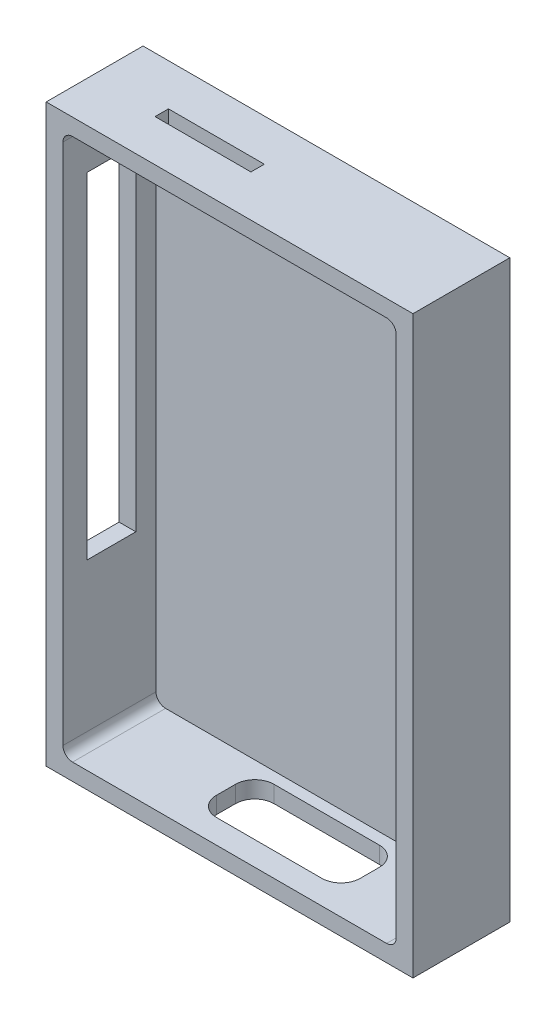
ISO-10303-21;
HEADER;
FILE_DESCRIPTION(('STEP AP214'),'2;1');
FILE_NAME('part.step','',(''),(''),'','','');
FILE_SCHEMA(('AUTOMOTIVE_DESIGN { 1 0 10303 214 1 1 1 1 }'));
ENDSEC;
DATA;
#1=APPLICATION_CONTEXT('core data for automotive mechanical design processes');
#2=APPLICATION_PROTOCOL_DEFINITION('international standard','automotive_design',2000,#1);
#3=PRODUCT_CONTEXT('',#1,'mechanical');
#4=PRODUCT('Part','Part','',(#3));
#5=PRODUCT_RELATED_PRODUCT_CATEGORY('part','',(#4));
#6=PRODUCT_DEFINITION_FORMATION('','',#4);
#7=PRODUCT_DEFINITION_CONTEXT('part definition',#1,'design');
#8=PRODUCT_DEFINITION('design','',#6,#7);
#9=PRODUCT_DEFINITION_SHAPE('','',#8);
#10=(LENGTH_UNIT() NAMED_UNIT(*) SI_UNIT(.MILLI.,.METRE.));
#11=(NAMED_UNIT(*) PLANE_ANGLE_UNIT() SI_UNIT($,.RADIAN.));
#12=(NAMED_UNIT(*) SI_UNIT($,.STERADIAN.) SOLID_ANGLE_UNIT());
#13=UNCERTAINTY_MEASURE_WITH_UNIT(LENGTH_MEASURE(1.E-05),#10,'distance_accuracy_value','');
#14=(GEOMETRIC_REPRESENTATION_CONTEXT(3) GLOBAL_UNCERTAINTY_ASSIGNED_CONTEXT((#13)) GLOBAL_UNIT_ASSIGNED_CONTEXT((#10,
#11,#12)) REPRESENTATION_CONTEXT('',''));
#15=CARTESIAN_POINT('',(0.,0.,0.));
#16=DIRECTION('',(0.,0.,1.));
#17=DIRECTION('',(1.,0.,0.));
#18=AXIS2_PLACEMENT_3D('',#15,#16,#17);
#19=CARTESIAN_POINT('',(0.,0.,0.8));
#20=DIRECTION('',(1.,0.,0.));
#21=DIRECTION('',(0.,0.,-1.));
#22=AXIS2_PLACEMENT_3D('',#19,#20,#21);
#23=PLANE('',#22);
#24=DIRECTION('',(0.,1.,0.));
#25=VECTOR('',#24,1.);
#26=CARTESIAN_POINT('',(0.,106.5,15.2));
#27=LINE('',#26,#25);
#28=CARTESIAN_POINT('',(0.,36.5,15.2));
#29=VERTEX_POINT('',#28);
#30=CARTESIAN_POINT('',(0.,106.5,15.2));
#31=VERTEX_POINT('',#30);
#32=EDGE_CURVE('E267',#29,#31,#27,.T.);
#33=ORIENTED_EDGE('',*,*,#32,.F.);
#34=DIRECTION('',(0.,0.,1.));
#35=VECTOR('',#34,1.);
#36=CARTESIAN_POINT('',(0.,36.5,5.00000000000001));
#37=LINE('',#36,#35);
#38=CARTESIAN_POINT('',(0.,36.5,5.00000000000001));
#39=VERTEX_POINT('',#38);
#40=EDGE_CURVE('E270',#39,#29,#37,.T.);
#41=ORIENTED_EDGE('',*,*,#40,.F.);
#42=DIRECTION('',(0.,-1.,0.));
#43=VECTOR('',#42,1.);
#44=CARTESIAN_POINT('',(0.,106.5,5.));
#45=LINE('',#44,#43);
#46=CARTESIAN_POINT('',(0.,106.5,5.));
#47=VERTEX_POINT('',#46);
#48=EDGE_CURVE('E263',#47,#39,#45,.T.);
#49=ORIENTED_EDGE('',*,*,#48,.F.);
#50=DIRECTION('',(0.,0.,-1.));
#51=VECTOR('',#50,1.);
#52=CARTESIAN_POINT('',(0.,106.5,5.));
#53=LINE('',#52,#51);
#54=EDGE_CURVE('E264',#31,#47,#53,.T.);
#55=ORIENTED_EDGE('',*,*,#54,.F.);
#56=EDGE_LOOP('',(#33,#41,#49,#55));
#57=FACE_BOUND('',#56,.T.);
#58=DIRECTION('',(0.,-1.,0.));
#59=VECTOR('',#58,1.);
#60=CARTESIAN_POINT('',(0.,0.,0.));
#61=LINE('',#60,#59);
#62=CARTESIAN_POINT('',(0.,120.,0.));
#63=VERTEX_POINT('',#62);
#64=CARTESIAN_POINT('',(0.,0.,0.));
#65=VERTEX_POINT('',#64);
#66=EDGE_CURVE('E331',#63,#65,#61,.T.);
#67=ORIENTED_EDGE('',*,*,#66,.T.);
#68=DIRECTION('',(0.,0.,-1.));
#69=VECTOR('',#68,1.);
#70=CARTESIAN_POINT('',(0.,0.,0.8));
#71=LINE('',#70,#69);
#72=CARTESIAN_POINT('',(0.,0.,20.2));
#73=VERTEX_POINT('',#72);
#74=EDGE_CURVE('E349',#73,#65,#71,.T.);
#75=ORIENTED_EDGE('',*,*,#74,.F.);
#76=DIRECTION('',(0.,-1.,0.));
#77=VECTOR('',#76,1.);
#78=CARTESIAN_POINT('',(0.,120.,20.2));
#79=LINE('',#78,#77);
#80=CARTESIAN_POINT('',(0.,120.,20.2));
#81=VERTEX_POINT('',#80);
#82=EDGE_CURVE('E309',#81,#73,#79,.T.);
#83=ORIENTED_EDGE('',*,*,#82,.F.);
#84=DIRECTION('',(0.,0.,-1.));
#85=VECTOR('',#84,1.);
#86=CARTESIAN_POINT('',(0.,120.,0.8));
#87=LINE('',#86,#85);
#88=EDGE_CURVE('E340',#81,#63,#87,.T.);
#89=ORIENTED_EDGE('',*,*,#88,.T.);
#90=EDGE_LOOP('',(#67,#75,#83,#89));
#91=FACE_BOUND('',#90,.T.);
#92=ADVANCED_FACE('F32',(#57,#91),#23,.F.);
#93=CARTESIAN_POINT('',(0.,0.,0.8));
#94=DIRECTION('',(0.,1.,0.));
#95=DIRECTION('',(0.,0.,1.));
#96=AXIS2_PLACEMENT_3D('',#93,#94,#95);
#97=PLANE('',#96);
#98=DIRECTION('',(-1.,0.,0.));
#99=VECTOR('',#98,1.);
#100=CARTESIAN_POINT('',(56.5,0.,15.2));
#101=LINE('',#100,#99);
#102=CARTESIAN_POINT('',(52.5,0.,15.2));
#103=VERTEX_POINT('',#102);
#104=CARTESIAN_POINT('',(30.5,0.,15.2));
#105=VERTEX_POINT('',#104);
#106=EDGE_CURVE('E254',#103,#105,#101,.T.);
#107=ORIENTED_EDGE('',*,*,#106,.F.);
#108=CARTESIAN_POINT('',(52.5,0.,11.2));
#109=DIRECTION('',(0.,1.,0.));
#110=DIRECTION('',(0.,0.,1.));
#111=AXIS2_PLACEMENT_3D('',#108,#109,#110);
#112=CIRCLE('',#111,4.);
#113=CARTESIAN_POINT('',(56.5,0.,11.2));
#114=VERTEX_POINT('',#113);
#115=EDGE_CURVE('E428',#103,#114,#112,.T.);
#116=ORIENTED_EDGE('',*,*,#115,.T.);
#117=DIRECTION('',(0.,0.,1.));
#118=VECTOR('',#117,1.);
#119=CARTESIAN_POINT('',(56.5,0.,15.2));
#120=LINE('',#119,#118);
#121=CARTESIAN_POINT('',(56.5,0.,7.19999999999999));
#122=VERTEX_POINT('',#121);
#123=EDGE_CURVE('E233',#122,#114,#120,.T.);
#124=ORIENTED_EDGE('',*,*,#123,.F.);
#125=CARTESIAN_POINT('',(52.5,0.,7.19999999999999));
#126=DIRECTION('',(0.,1.,0.));
#127=DIRECTION('',(0.,0.,1.));
#128=AXIS2_PLACEMENT_3D('',#125,#126,#127);
#129=CIRCLE('',#128,4.);
#130=CARTESIAN_POINT('',(52.5,0.,3.19999999999999));
#131=VERTEX_POINT('',#130);
#132=EDGE_CURVE('E40',#122,#131,#129,.T.);
#133=ORIENTED_EDGE('',*,*,#132,.T.);
#134=DIRECTION('',(1.,0.,0.));
#135=VECTOR('',#134,1.);
#136=CARTESIAN_POINT('',(56.5,0.,3.19999999999999));
#137=LINE('',#136,#135);
#138=CARTESIAN_POINT('',(30.5,0.,3.19999999999999));
#139=VERTEX_POINT('',#138);
#140=EDGE_CURVE('E260',#139,#131,#137,.T.);
#141=ORIENTED_EDGE('',*,*,#140,.F.);
#142=CARTESIAN_POINT('',(30.5,0.,7.19999999999999));
#143=DIRECTION('',(0.,1.,0.));
#144=DIRECTION('',(0.,0.,1.));
#145=AXIS2_PLACEMENT_3D('',#142,#143,#144);
#146=CIRCLE('',#145,4.);
#147=CARTESIAN_POINT('',(26.5,0.,7.19999999999999));
#148=VERTEX_POINT('',#147);
#149=EDGE_CURVE('E424',#139,#148,#146,.T.);
#150=ORIENTED_EDGE('',*,*,#149,.T.);
#151=DIRECTION('',(0.,0.,-1.));
#152=VECTOR('',#151,1.);
#153=CARTESIAN_POINT('',(26.5,0.,15.2));
#154=LINE('',#153,#152);
#155=CARTESIAN_POINT('',(26.5,0.,11.2));
#156=VERTEX_POINT('',#155);
#157=EDGE_CURVE('E257',#156,#148,#154,.T.);
#158=ORIENTED_EDGE('',*,*,#157,.F.);
#159=CARTESIAN_POINT('',(30.5,0.,11.2));
#160=DIRECTION('',(0.,1.,0.));
#161=DIRECTION('',(0.,0.,1.));
#162=AXIS2_PLACEMENT_3D('',#159,#160,#161);
#163=CIRCLE('',#162,4.);
#164=EDGE_CURVE('E420',#156,#105,#163,.T.);
#165=ORIENTED_EDGE('',*,*,#164,.T.);
#166=EDGE_LOOP('',(#107,#116,#124,#133,#141,#150,#158,#165));
#167=FACE_BOUND('',#166,.T.);
#168=DIRECTION('',(1.,0.,0.));
#169=VECTOR('',#168,1.);
#170=CARTESIAN_POINT('',(0.,0.,0.));
#171=LINE('',#170,#169);
#172=CARTESIAN_POINT('',(76.5,0.,0.));
#173=VERTEX_POINT('',#172);
#174=EDGE_CURVE('E334',#65,#173,#171,.T.);
#175=ORIENTED_EDGE('',*,*,#174,.T.);
#176=DIRECTION('',(0.,0.,-1.));
#177=VECTOR('',#176,1.);
#178=CARTESIAN_POINT('',(76.5,0.,0.8));
#179=LINE('',#178,#177);
#180=CARTESIAN_POINT('',(76.5,0.,20.2));
#181=VERTEX_POINT('',#180);
#182=EDGE_CURVE('E346',#181,#173,#179,.T.);
#183=ORIENTED_EDGE('',*,*,#182,.F.);
#184=DIRECTION('',(1.,0.,0.));
#185=VECTOR('',#184,1.);
#186=CARTESIAN_POINT('',(0.,0.,20.2));
#187=LINE('',#186,#185);
#188=EDGE_CURVE('E322',#73,#181,#187,.T.);
#189=ORIENTED_EDGE('',*,*,#188,.F.);
#190=ORIENTED_EDGE('',*,*,#74,.T.);
#191=EDGE_LOOP('',(#175,#183,#189,#190));
#192=FACE_BOUND('',#191,.T.);
#193=ADVANCED_FACE('F435',(#167,#192),#97,.F.);
#194=CARTESIAN_POINT('',(76.5,0.,0.8));
#195=DIRECTION('',(-1.,0.,0.));
#196=DIRECTION('',(0.,0.,1.));
#197=AXIS2_PLACEMENT_3D('',#194,#195,#196);
#198=PLANE('',#197);
#199=DIRECTION('',(0.,1.,0.));
#200=VECTOR('',#199,1.);
#201=CARTESIAN_POINT('',(76.5,0.,0.));
#202=LINE('',#201,#200);
#203=CARTESIAN_POINT('',(76.5,120.,0.));
#204=VERTEX_POINT('',#203);
#205=EDGE_CURVE('E336',#173,#204,#202,.T.);
#206=ORIENTED_EDGE('',*,*,#205,.T.);
#207=DIRECTION('',(0.,0.,-1.));
#208=VECTOR('',#207,1.);
#209=CARTESIAN_POINT('',(76.5,120.,0.8));
#210=LINE('',#209,#208);
#211=CARTESIAN_POINT('',(76.5,120.,20.2));
#212=VERTEX_POINT('',#211);
#213=EDGE_CURVE('E343',#212,#204,#210,.T.);
#214=ORIENTED_EDGE('',*,*,#213,.F.);
#215=DIRECTION('',(0.,1.,0.));
#216=VECTOR('',#215,1.);
#217=CARTESIAN_POINT('',(76.5,120.,20.2));
#218=LINE('',#217,#216);
#219=EDGE_CURVE('E325',#181,#212,#218,.T.);
#220=ORIENTED_EDGE('',*,*,#219,.F.);
#221=ORIENTED_EDGE('',*,*,#182,.T.);
#222=EDGE_LOOP('',(#206,#214,#220,#221));
#223=FACE_BOUND('',#222,.T.);
#224=ADVANCED_FACE('F485',(#223),#198,.F.);
#225=CARTESIAN_POINT('',(0.,120.,0.8));
#226=DIRECTION('',(0.,-1.,0.));
#227=DIRECTION('',(0.,0.,-1.));
#228=AXIS2_PLACEMENT_3D('',#225,#226,#227);
#229=PLANE('',#228);
#230=DIRECTION('',(0.,0.,-1.));
#231=VECTOR('',#230,1.);
#232=CARTESIAN_POINT('',(34.,120.,11.5));
#233=LINE('',#232,#231);
#234=CARTESIAN_POINT('',(34.,120.,11.5));
#235=VERTEX_POINT('',#234);
#236=CARTESIAN_POINT('',(34.,120.,8.7));
#237=VERTEX_POINT('',#236);
#238=EDGE_CURVE('E47',#235,#237,#233,.T.);
#239=ORIENTED_EDGE('',*,*,#238,.F.);
#240=DIRECTION('',(1.,0.,0.));
#241=VECTOR('',#240,1.);
#242=CARTESIAN_POINT('',(14.,120.,11.5));
#243=LINE('',#242,#241);
#244=CARTESIAN_POINT('',(14.,120.,11.5));
#245=VERTEX_POINT('',#244);
#246=EDGE_CURVE('E226',#245,#235,#243,.T.);
#247=ORIENTED_EDGE('',*,*,#246,.F.);
#248=DIRECTION('',(0.,0.,1.));
#249=VECTOR('',#248,1.);
#250=CARTESIAN_POINT('',(14.,120.,11.5));
#251=LINE('',#250,#249);
#252=CARTESIAN_POINT('',(14.,120.,8.7));
#253=VERTEX_POINT('',#252);
#254=EDGE_CURVE('E234',#253,#245,#251,.T.);
#255=ORIENTED_EDGE('',*,*,#254,.F.);
#256=DIRECTION('',(-1.,0.,0.));
#257=VECTOR('',#256,1.);
#258=CARTESIAN_POINT('',(14.,120.,8.7));
#259=LINE('',#258,#257);
#260=EDGE_CURVE('E239',#237,#253,#259,.T.);
#261=ORIENTED_EDGE('',*,*,#260,.F.);
#262=EDGE_LOOP('',(#239,#247,#255,#261));
#263=FACE_BOUND('',#262,.T.);
#264=DIRECTION('',(-1.,0.,0.));
#265=VECTOR('',#264,1.);
#266=CARTESIAN_POINT('',(0.,120.,0.));
#267=LINE('',#266,#265);
#268=EDGE_CURVE('E338',#204,#63,#267,.T.);
#269=ORIENTED_EDGE('',*,*,#268,.T.);
#270=ORIENTED_EDGE('',*,*,#88,.F.);
#271=DIRECTION('',(-1.,0.,0.));
#272=VECTOR('',#271,1.);
#273=CARTESIAN_POINT('',(0.,120.,20.2));
#274=LINE('',#273,#272);
#275=EDGE_CURVE('E328',#212,#81,#274,.T.);
#276=ORIENTED_EDGE('',*,*,#275,.F.);
#277=ORIENTED_EDGE('',*,*,#213,.T.);
#278=EDGE_LOOP('',(#269,#270,#276,#277));
#279=FACE_BOUND('',#278,.T.);
#280=ADVANCED_FACE('F237',(#263,#279),#229,.F.);
#281=CARTESIAN_POINT('',(0.,0.,0.));
#282=DIRECTION('',(0.,0.,-1.));
#283=DIRECTION('',(-1.,0.,0.));
#284=AXIS2_PLACEMENT_3D('',#281,#282,#283);
#285=PLANE('',#284);
#286=ORIENTED_EDGE('',*,*,#66,.F.);
#287=ORIENTED_EDGE('',*,*,#268,.F.);
#288=ORIENTED_EDGE('',*,*,#205,.F.);
#289=ORIENTED_EDGE('',*,*,#174,.F.);
#290=EDGE_LOOP('',(#286,#287,#288,#289));
#291=FACE_BOUND('',#290,.T.);
#292=ADVANCED_FACE('F552',(#291),#285,.T.);
#293=CARTESIAN_POINT('',(0.,0.,20.2));
#294=DIRECTION('',(0.,0.,1.));
#295=DIRECTION('',(1.,0.,0.));
#296=AXIS2_PLACEMENT_3D('',#293,#294,#295);
#297=PLANE('',#296);
#298=ORIENTED_EDGE('',*,*,#82,.T.);
#299=ORIENTED_EDGE('',*,*,#188,.T.);
#300=ORIENTED_EDGE('',*,*,#219,.T.);
#301=ORIENTED_EDGE('',*,*,#275,.T.);
#302=EDGE_LOOP('',(#298,#299,#300,#301));
#303=FACE_BOUND('',#302,.T.);
#304=DIRECTION('',(-1.,0.,0.));
#305=VECTOR('',#304,1.);
#306=CARTESIAN_POINT('',(73.,116.5,20.2));
#307=LINE('',#306,#305);
#308=CARTESIAN_POINT('',(71.,116.5,20.2));
#309=VERTEX_POINT('',#308);
#310=CARTESIAN_POINT('',(5.50000000000001,116.5,20.2));
#311=VERTEX_POINT('',#310);
#312=EDGE_CURVE('E299',#309,#311,#307,.T.);
#313=ORIENTED_EDGE('',*,*,#312,.F.);
#314=CARTESIAN_POINT('',(71.,114.5,20.2));
#315=DIRECTION('',(0.,0.,1.));
#316=DIRECTION('',(1.,0.,0.));
#317=AXIS2_PLACEMENT_3D('',#314,#315,#316);
#318=CIRCLE('',#317,2.);
#319=CARTESIAN_POINT('',(73.,114.5,20.2));
#320=VERTEX_POINT('',#319);
#321=EDGE_CURVE('E380',#309,#320,#318,.F.);
#322=ORIENTED_EDGE('',*,*,#321,.T.);
#323=DIRECTION('',(0.,1.,0.));
#324=VECTOR('',#323,1.);
#325=CARTESIAN_POINT('',(73.,3.5,20.2));
#326=LINE('',#325,#324);
#327=CARTESIAN_POINT('',(73.,5.5,20.2));
#328=VERTEX_POINT('',#327);
#329=EDGE_CURVE('E296',#328,#320,#326,.T.);
#330=ORIENTED_EDGE('',*,*,#329,.F.);
#331=CARTESIAN_POINT('',(71.,5.5,20.2));
#332=DIRECTION('',(0.,0.,1.));
#333=DIRECTION('',(1.,0.,0.));
#334=AXIS2_PLACEMENT_3D('',#331,#332,#333);
#335=CIRCLE('',#334,2.);
#336=CARTESIAN_POINT('',(71.,3.5,20.2));
#337=VERTEX_POINT('',#336);
#338=EDGE_CURVE('E382',#328,#337,#335,.F.);
#339=ORIENTED_EDGE('',*,*,#338,.T.);
#340=DIRECTION('',(1.,0.,0.));
#341=VECTOR('',#340,1.);
#342=CARTESIAN_POINT('',(73.,3.5,20.2));
#343=LINE('',#342,#341);
#344=CARTESIAN_POINT('',(5.50000000000001,3.49999999999999,20.2));
#345=VERTEX_POINT('',#344);
#346=EDGE_CURVE('E306',#345,#337,#343,.T.);
#347=ORIENTED_EDGE('',*,*,#346,.F.);
#348=CARTESIAN_POINT('',(5.5,5.49999999999999,20.2));
#349=DIRECTION('',(0.,0.,1.));
#350=DIRECTION('',(1.,0.,0.));
#351=AXIS2_PLACEMENT_3D('',#348,#349,#350);
#352=CIRCLE('',#351,2.);
#353=CARTESIAN_POINT('',(3.5,5.49999999999999,20.2));
#354=VERTEX_POINT('',#353);
#355=EDGE_CURVE('E384',#345,#354,#352,.F.);
#356=ORIENTED_EDGE('',*,*,#355,.T.);
#357=DIRECTION('',(0.,-1.,0.));
#358=VECTOR('',#357,1.);
#359=CARTESIAN_POINT('',(3.5,3.49999999999999,20.2));
#360=LINE('',#359,#358);
#361=CARTESIAN_POINT('',(3.5,114.5,20.2));
#362=VERTEX_POINT('',#361);
#363=EDGE_CURVE('E303',#362,#354,#360,.T.);
#364=ORIENTED_EDGE('',*,*,#363,.F.);
#365=CARTESIAN_POINT('',(5.50000000000001,114.5,20.2));
#366=DIRECTION('',(0.,0.,1.));
#367=DIRECTION('',(1.,0.,0.));
#368=AXIS2_PLACEMENT_3D('',#365,#366,#367);
#369=CIRCLE('',#368,2.);
#370=EDGE_CURVE('E386',#362,#311,#369,.F.);
#371=ORIENTED_EDGE('',*,*,#370,.T.);
#372=EDGE_LOOP('',(#313,#322,#330,#339,#347,#356,#364,#371));
#373=FACE_BOUND('',#372,.T.);
#374=ADVANCED_FACE('F520',(#303,#373),#297,.T.);
#375=CARTESIAN_POINT('',(73.,3.5,20.2));
#376=DIRECTION('',(-1.,0.,0.));
#377=DIRECTION('',(0.,0.,1.));
#378=AXIS2_PLACEMENT_3D('',#375,#376,#377);
#379=PLANE('',#378);
#380=ORIENTED_EDGE('',*,*,#329,.T.);
#381=DIRECTION('',(0.,0.,-1.));
#382=VECTOR('',#381,1.);
#383=CARTESIAN_POINT('',(73.,114.5,0.799999999999999));
#384=LINE('',#383,#382);
#385=CARTESIAN_POINT('',(73.,114.5,0.8));
#386=VERTEX_POINT('',#385);
#387=EDGE_CURVE('E354',#320,#386,#384,.T.);
#388=ORIENTED_EDGE('',*,*,#387,.T.);
#389=DIRECTION('',(0.,1.,0.));
#390=VECTOR('',#389,1.);
#391=CARTESIAN_POINT('',(73.,3.5,0.8));
#392=LINE('',#391,#390);
#393=CARTESIAN_POINT('',(73.,5.5,0.8));
#394=VERTEX_POINT('',#393);
#395=EDGE_CURVE('E295',#394,#386,#392,.T.);
#396=ORIENTED_EDGE('',*,*,#395,.F.);
#397=DIRECTION('',(0.,0.,-1.));
#398=VECTOR('',#397,1.);
#399=CARTESIAN_POINT('',(73.,5.5,20.2));
#400=LINE('',#399,#398);
#401=EDGE_CURVE('E352',#394,#328,#400,.F.);
#402=ORIENTED_EDGE('',*,*,#401,.T.);
#403=EDGE_LOOP('',(#380,#388,#396,#402));
#404=FACE_BOUND('',#403,.T.);
#405=ADVANCED_FACE('F530',(#404),#379,.T.);
#406=CARTESIAN_POINT('',(73.,116.5,20.2));
#407=DIRECTION('',(0.,-1.,0.));
#408=DIRECTION('',(1.,0.,0.));
#409=AXIS2_PLACEMENT_3D('',#406,#407,#408);
#410=PLANE('',#409);
#411=DIRECTION('',(1.,0.,0.));
#412=VECTOR('',#411,1.);
#413=CARTESIAN_POINT('',(14.,116.5,11.5));
#414=LINE('',#413,#412);
#415=CARTESIAN_POINT('',(14.,116.5,11.5));
#416=VERTEX_POINT('',#415);
#417=CARTESIAN_POINT('',(34.,116.5,11.5));
#418=VERTEX_POINT('',#417);
#419=EDGE_CURVE('E223',#416,#418,#414,.T.);
#420=ORIENTED_EDGE('',*,*,#419,.T.);
#421=DIRECTION('',(0.,0.,-1.));
#422=VECTOR('',#421,1.);
#423=CARTESIAN_POINT('',(34.,116.5,11.5));
#424=LINE('',#423,#422);
#425=CARTESIAN_POINT('',(34.,116.5,8.7));
#426=VERTEX_POINT('',#425);
#427=EDGE_CURVE('E219',#418,#426,#424,.T.);
#428=ORIENTED_EDGE('',*,*,#427,.T.);
#429=DIRECTION('',(-1.,0.,0.));
#430=VECTOR('',#429,1.);
#431=CARTESIAN_POINT('',(14.,116.5,8.7));
#432=LINE('',#431,#430);
#433=CARTESIAN_POINT('',(14.,116.5,8.7));
#434=VERTEX_POINT('',#433);
#435=EDGE_CURVE('E222',#426,#434,#432,.T.);
#436=ORIENTED_EDGE('',*,*,#435,.T.);
#437=DIRECTION('',(0.,0.,1.));
#438=VECTOR('',#437,1.);
#439=CARTESIAN_POINT('',(14.,116.5,11.5));
#440=LINE('',#439,#438);
#441=EDGE_CURVE('E248',#434,#416,#440,.T.);
#442=ORIENTED_EDGE('',*,*,#441,.T.);
#443=EDGE_LOOP('',(#420,#428,#436,#442));
#444=FACE_BOUND('',#443,.T.);
#445=DIRECTION('',(-1.,0.,0.));
#446=VECTOR('',#445,1.);
#447=CARTESIAN_POINT('',(73.,116.5,0.8));
#448=LINE('',#447,#446);
#449=CARTESIAN_POINT('',(71.,116.5,0.8));
#450=VERTEX_POINT('',#449);
#451=CARTESIAN_POINT('',(5.50000000000001,116.5,0.8));
#452=VERTEX_POINT('',#451);
#453=EDGE_CURVE('E312',#450,#452,#448,.T.);
#454=ORIENTED_EDGE('',*,*,#453,.F.);
#455=DIRECTION('',(0.,0.,-1.));
#456=VECTOR('',#455,1.);
#457=CARTESIAN_POINT('',(71.,116.5,20.2));
#458=LINE('',#457,#456);
#459=EDGE_CURVE('E368',#450,#309,#458,.F.);
#460=ORIENTED_EDGE('',*,*,#459,.T.);
#461=ORIENTED_EDGE('',*,*,#312,.T.);
#462=DIRECTION('',(0.,0.,-1.));
#463=VECTOR('',#462,1.);
#464=CARTESIAN_POINT('',(5.50000000000001,116.5,0.799999999999999));
#465=LINE('',#464,#463);
#466=EDGE_CURVE('E365',#311,#452,#465,.T.);
#467=ORIENTED_EDGE('',*,*,#466,.T.);
#468=EDGE_LOOP('',(#454,#460,#461,#467));
#469=FACE_BOUND('',#468,.T.);
#470=ADVANCED_FACE('F524',(#444,#469),#410,.T.);
#471=CARTESIAN_POINT('',(3.5,3.49999999999999,20.2));
#472=DIRECTION('',(1.,0.,0.));
#473=DIRECTION('',(0.,1.,0.));
#474=AXIS2_PLACEMENT_3D('',#471,#472,#473);
#475=PLANE('',#474);
#476=DIRECTION('',(0.,0.,1.));
#477=VECTOR('',#476,1.);
#478=CARTESIAN_POINT('',(3.5,36.5,5.00000000000001));
#479=LINE('',#478,#477);
#480=CARTESIAN_POINT('',(3.5,36.5,5.00000000000001));
#481=VERTEX_POINT('',#480);
#482=CARTESIAN_POINT('',(3.5,36.5,15.2));
#483=VERTEX_POINT('',#482);
#484=EDGE_CURVE('E266',#481,#483,#479,.T.);
#485=ORIENTED_EDGE('',*,*,#484,.T.);
#486=DIRECTION('',(0.,1.,0.));
#487=VECTOR('',#486,1.);
#488=CARTESIAN_POINT('',(3.5,106.5,15.2));
#489=LINE('',#488,#487);
#490=CARTESIAN_POINT('',(3.5,106.5,15.2));
#491=VERTEX_POINT('',#490);
#492=EDGE_CURVE('E287',#483,#491,#489,.T.);
#493=ORIENTED_EDGE('',*,*,#492,.T.);
#494=DIRECTION('',(0.,0.,-1.));
#495=VECTOR('',#494,1.);
#496=CARTESIAN_POINT('',(3.5,106.5,5.));
#497=LINE('',#496,#495);
#498=CARTESIAN_POINT('',(3.5,106.5,5.));
#499=VERTEX_POINT('',#498);
#500=EDGE_CURVE('E283',#491,#499,#497,.T.);
#501=ORIENTED_EDGE('',*,*,#500,.T.);
#502=DIRECTION('',(0.,-1.,0.));
#503=VECTOR('',#502,1.);
#504=CARTESIAN_POINT('',(3.5,106.5,5.));
#505=LINE('',#504,#503);
#506=EDGE_CURVE('E278',#499,#481,#505,.T.);
#507=ORIENTED_EDGE('',*,*,#506,.T.);
#508=EDGE_LOOP('',(#485,#493,#501,#507));
#509=FACE_BOUND('',#508,.T.);
#510=ORIENTED_EDGE('',*,*,#363,.T.);
#511=DIRECTION('',(0.,0.,-1.));
#512=VECTOR('',#511,1.);
#513=CARTESIAN_POINT('',(3.5,5.49999999999999,0.799999999999999));
#514=LINE('',#513,#512);
#515=CARTESIAN_POINT('',(3.5,5.49999999999999,0.8));
#516=VERTEX_POINT('',#515);
#517=EDGE_CURVE('E377',#354,#516,#514,.T.);
#518=ORIENTED_EDGE('',*,*,#517,.T.);
#519=DIRECTION('',(0.,-1.,0.));
#520=VECTOR('',#519,1.);
#521=CARTESIAN_POINT('',(3.5,3.49999999999999,0.8));
#522=LINE('',#521,#520);
#523=CARTESIAN_POINT('',(3.5,114.5,0.8));
#524=VERTEX_POINT('',#523);
#525=EDGE_CURVE('E315',#524,#516,#522,.T.);
#526=ORIENTED_EDGE('',*,*,#525,.F.);
#527=DIRECTION('',(0.,0.,-1.));
#528=VECTOR('',#527,1.);
#529=CARTESIAN_POINT('',(3.5,114.5,20.2));
#530=LINE('',#529,#528);
#531=EDGE_CURVE('E375',#524,#362,#530,.F.);
#532=ORIENTED_EDGE('',*,*,#531,.T.);
#533=EDGE_LOOP('',(#510,#518,#526,#532));
#534=FACE_BOUND('',#533,.T.);
#535=ADVANCED_FACE('F540',(#509,#534),#475,.T.);
#536=CARTESIAN_POINT('',(73.,3.5,20.2));
#537=DIRECTION('',(0.,1.,0.));
#538=DIRECTION('',(-1.,0.,0.));
#539=AXIS2_PLACEMENT_3D('',#536,#537,#538);
#540=PLANE('',#539);
#541=DIRECTION('',(0.,0.,-1.));
#542=VECTOR('',#541,1.);
#543=CARTESIAN_POINT('',(56.5,3.5,20.2));
#544=LINE('',#543,#542);
#545=CARTESIAN_POINT('',(56.5,3.5,11.2));
#546=VERTEX_POINT('',#545);
#547=CARTESIAN_POINT('',(56.5,3.5,7.19999999999999));
#548=VERTEX_POINT('',#547);
#549=EDGE_CURVE('E397',#546,#548,#544,.T.);
#550=ORIENTED_EDGE('',*,*,#549,.F.);
#551=CARTESIAN_POINT('',(52.5,3.5,11.2));
#552=DIRECTION('',(0.,1.,0.));
#553=DIRECTION('',(-1.,0.,0.));
#554=AXIS2_PLACEMENT_3D('',#551,#552,#553);
#555=CIRCLE('',#554,4.);
#556=CARTESIAN_POINT('',(52.5,3.5,15.2));
#557=VERTEX_POINT('',#556);
#558=EDGE_CURVE('E430',#546,#557,#555,.F.);
#559=ORIENTED_EDGE('',*,*,#558,.T.);
#560=DIRECTION('',(1.,0.,0.));
#561=VECTOR('',#560,1.);
#562=CARTESIAN_POINT('',(73.,3.5,15.2));
#563=LINE('',#562,#561);
#564=CARTESIAN_POINT('',(30.5,3.49999999999999,15.2));
#565=VERTEX_POINT('',#564);
#566=EDGE_CURVE('E388',#565,#557,#563,.T.);
#567=ORIENTED_EDGE('',*,*,#566,.F.);
#568=CARTESIAN_POINT('',(30.5,3.49999999999999,11.2));
#569=DIRECTION('',(0.,1.,0.));
#570=DIRECTION('',(-1.,0.,0.));
#571=AXIS2_PLACEMENT_3D('',#568,#569,#570);
#572=CIRCLE('',#571,4.);
#573=CARTESIAN_POINT('',(26.5,3.49999999999999,11.2));
#574=VERTEX_POINT('',#573);
#575=EDGE_CURVE('E422',#565,#574,#572,.F.);
#576=ORIENTED_EDGE('',*,*,#575,.T.);
#577=DIRECTION('',(0.,0.,1.));
#578=VECTOR('',#577,1.);
#579=CARTESIAN_POINT('',(26.5,3.49999999999999,20.2));
#580=LINE('',#579,#578);
#581=CARTESIAN_POINT('',(26.5,3.49999999999999,7.19999999999999));
#582=VERTEX_POINT('',#581);
#583=EDGE_CURVE('E391',#582,#574,#580,.T.);
#584=ORIENTED_EDGE('',*,*,#583,.F.);
#585=CARTESIAN_POINT('',(30.5,3.49999999999999,7.19999999999999));
#586=DIRECTION('',(0.,1.,0.));
#587=DIRECTION('',(-1.,0.,0.));
#588=AXIS2_PLACEMENT_3D('',#585,#586,#587);
#589=CIRCLE('',#588,4.);
#590=CARTESIAN_POINT('',(30.5,3.49999999999999,3.19999999999999));
#591=VERTEX_POINT('',#590);
#592=EDGE_CURVE('E426',#582,#591,#589,.F.);
#593=ORIENTED_EDGE('',*,*,#592,.T.);
#594=DIRECTION('',(-1.,0.,0.));
#595=VECTOR('',#594,1.);
#596=CARTESIAN_POINT('',(73.,3.5,3.19999999999999));
#597=LINE('',#596,#595);
#598=CARTESIAN_POINT('',(52.5,3.5,3.19999999999999));
#599=VERTEX_POINT('',#598);
#600=EDGE_CURVE('E394',#599,#591,#597,.T.);
#601=ORIENTED_EDGE('',*,*,#600,.F.);
#602=CARTESIAN_POINT('',(52.5,3.5,7.19999999999999));
#603=DIRECTION('',(0.,1.,0.));
#604=DIRECTION('',(-1.,0.,0.));
#605=AXIS2_PLACEMENT_3D('',#602,#603,#604);
#606=CIRCLE('',#605,4.);
#607=EDGE_CURVE('E11',#599,#548,#606,.F.);
#608=ORIENTED_EDGE('',*,*,#607,.T.);
#609=EDGE_LOOP('',(#550,#559,#567,#576,#584,#593,#601,#608));
#610=FACE_BOUND('',#609,.T.);
#611=ORIENTED_EDGE('',*,*,#346,.T.);
#612=DIRECTION('',(0.,0.,-1.));
#613=VECTOR('',#612,1.);
#614=CARTESIAN_POINT('',(71.,3.5,0.799999999999999));
#615=LINE('',#614,#613);
#616=CARTESIAN_POINT('',(71.,3.5,0.8));
#617=VERTEX_POINT('',#616);
#618=EDGE_CURVE('E372',#337,#617,#615,.T.);
#619=ORIENTED_EDGE('',*,*,#618,.T.);
#620=DIRECTION('',(1.,0.,0.));
#621=VECTOR('',#620,1.);
#622=CARTESIAN_POINT('',(73.,3.5,0.8));
#623=LINE('',#622,#621);
#624=CARTESIAN_POINT('',(5.50000000000001,3.49999999999999,0.8));
#625=VERTEX_POINT('',#624);
#626=EDGE_CURVE('E300',#625,#617,#623,.T.);
#627=ORIENTED_EDGE('',*,*,#626,.F.);
#628=DIRECTION('',(0.,0.,-1.));
#629=VECTOR('',#628,1.);
#630=CARTESIAN_POINT('',(5.5,3.49999999999999,20.2));
#631=LINE('',#630,#629);
#632=EDGE_CURVE('E370',#625,#345,#631,.F.);
#633=ORIENTED_EDGE('',*,*,#632,.T.);
#634=EDGE_LOOP('',(#611,#619,#627,#633));
#635=FACE_BOUND('',#634,.T.);
#636=ADVANCED_FACE('F447',(#610,#635),#540,.T.);
#637=CARTESIAN_POINT('',(0.,0.,0.8));
#638=DIRECTION('',(0.,0.,-1.));
#639=DIRECTION('',(-1.,0.,0.));
#640=AXIS2_PLACEMENT_3D('',#637,#638,#639);
#641=PLANE('',#640);
#642=ORIENTED_EDGE('',*,*,#395,.T.);
#643=CARTESIAN_POINT('',(71.,114.5,0.799999999999999));
#644=DIRECTION('',(0.,0.,-1.));
#645=DIRECTION('',(-1.,0.,0.));
#646=AXIS2_PLACEMENT_3D('',#643,#644,#645);
#647=CIRCLE('',#646,2.);
#648=EDGE_CURVE('E363',#386,#450,#647,.F.);
#649=ORIENTED_EDGE('',*,*,#648,.T.);
#650=ORIENTED_EDGE('',*,*,#453,.T.);
#651=CARTESIAN_POINT('',(5.50000000000001,114.5,0.799999999999999));
#652=DIRECTION('',(0.,0.,-1.));
#653=DIRECTION('',(-1.,0.,0.));
#654=AXIS2_PLACEMENT_3D('',#651,#652,#653);
#655=CIRCLE('',#654,2.);
#656=EDGE_CURVE('E357',#452,#524,#655,.F.);
#657=ORIENTED_EDGE('',*,*,#656,.T.);
#658=ORIENTED_EDGE('',*,*,#525,.T.);
#659=CARTESIAN_POINT('',(5.5,5.49999999999999,0.799999999999999));
#660=DIRECTION('',(0.,0.,-1.));
#661=DIRECTION('',(-1.,0.,0.));
#662=AXIS2_PLACEMENT_3D('',#659,#660,#661);
#663=CIRCLE('',#662,2.);
#664=EDGE_CURVE('E359',#516,#625,#663,.F.);
#665=ORIENTED_EDGE('',*,*,#664,.T.);
#666=ORIENTED_EDGE('',*,*,#626,.T.);
#667=CARTESIAN_POINT('',(71.,5.5,0.799999999999999));
#668=DIRECTION('',(0.,0.,-1.));
#669=DIRECTION('',(-1.,0.,0.));
#670=AXIS2_PLACEMENT_3D('',#667,#668,#669);
#671=CIRCLE('',#670,2.);
#672=EDGE_CURVE('E361',#617,#394,#671,.F.);
#673=ORIENTED_EDGE('',*,*,#672,.T.);
#674=EDGE_LOOP('',(#642,#649,#650,#657,#658,#665,#666,#673));
#675=FACE_BOUND('',#674,.T.);
#676=ADVANCED_FACE('F495',(#675),#641,.F.);
#677=CARTESIAN_POINT('',(71.,114.5,20.2));
#678=DIRECTION('',(0.,0.,1.));
#679=DIRECTION('',(1.,0.,0.));
#680=AXIS2_PLACEMENT_3D('',#677,#678,#679);
#681=CYLINDRICAL_SURFACE('',#680,2.);
#682=ORIENTED_EDGE('',*,*,#321,.F.);
#683=ORIENTED_EDGE('',*,*,#459,.F.);
#684=ORIENTED_EDGE('',*,*,#648,.F.);
#685=ORIENTED_EDGE('',*,*,#387,.F.);
#686=EDGE_LOOP('',(#682,#683,#684,#685));
#687=FACE_BOUND('',#686,.T.);
#688=ADVANCED_FACE('F491',(#687),#681,.F.);
#689=CARTESIAN_POINT('',(71.,5.5,20.2));
#690=DIRECTION('',(0.,0.,1.));
#691=DIRECTION('',(1.,0.,0.));
#692=AXIS2_PLACEMENT_3D('',#689,#690,#691);
#693=CYLINDRICAL_SURFACE('',#692,2.);
#694=ORIENTED_EDGE('',*,*,#338,.F.);
#695=ORIENTED_EDGE('',*,*,#401,.F.);
#696=ORIENTED_EDGE('',*,*,#672,.F.);
#697=ORIENTED_EDGE('',*,*,#618,.F.);
#698=EDGE_LOOP('',(#694,#695,#696,#697));
#699=FACE_BOUND('',#698,.T.);
#700=ADVANCED_FACE('F494',(#699),#693,.F.);
#701=CARTESIAN_POINT('',(5.5,5.49999999999999,20.2));
#702=DIRECTION('',(0.,0.,1.));
#703=DIRECTION('',(1.,0.,0.));
#704=AXIS2_PLACEMENT_3D('',#701,#702,#703);
#705=CYLINDRICAL_SURFACE('',#704,2.);
#706=ORIENTED_EDGE('',*,*,#355,.F.);
#707=ORIENTED_EDGE('',*,*,#632,.F.);
#708=ORIENTED_EDGE('',*,*,#664,.F.);
#709=ORIENTED_EDGE('',*,*,#517,.F.);
#710=EDGE_LOOP('',(#706,#707,#708,#709));
#711=FACE_BOUND('',#710,.T.);
#712=ADVANCED_FACE('F499',(#711),#705,.F.);
#713=CARTESIAN_POINT('',(5.50000000000001,114.5,20.2));
#714=DIRECTION('',(0.,0.,1.));
#715=DIRECTION('',(1.,0.,0.));
#716=AXIS2_PLACEMENT_3D('',#713,#714,#715);
#717=CYLINDRICAL_SURFACE('',#716,2.);
#718=ORIENTED_EDGE('',*,*,#370,.F.);
#719=ORIENTED_EDGE('',*,*,#531,.F.);
#720=ORIENTED_EDGE('',*,*,#656,.F.);
#721=ORIENTED_EDGE('',*,*,#466,.F.);
#722=EDGE_LOOP('',(#718,#719,#720,#721));
#723=FACE_BOUND('',#722,.T.);
#724=ADVANCED_FACE('F503',(#723),#717,.F.);
#725=CARTESIAN_POINT('',(74.2392394643878,36.5,5.00000000000001));
#726=DIRECTION('',(0.,-1.,0.));
#727=DIRECTION('',(0.,0.,-1.));
#728=AXIS2_PLACEMENT_3D('',#725,#726,#727);
#729=PLANE('',#728);
#730=DIRECTION('',(-1.,0.,0.));
#731=VECTOR('',#730,1.);
#732=CARTESIAN_POINT('',(74.2392394643878,36.5,5.00000000000001));
#733=LINE('',#732,#731);
#734=EDGE_CURVE('E281',#481,#39,#733,.T.);
#735=ORIENTED_EDGE('',*,*,#734,.T.);
#736=ORIENTED_EDGE('',*,*,#40,.T.);
#737=DIRECTION('',(-1.,0.,0.));
#738=VECTOR('',#737,1.);
#739=CARTESIAN_POINT('',(74.2392394643878,36.5,15.2));
#740=LINE('',#739,#738);
#741=EDGE_CURVE('E277',#483,#29,#740,.T.);
#742=ORIENTED_EDGE('',*,*,#741,.F.);
#743=ORIENTED_EDGE('',*,*,#484,.F.);
#744=EDGE_LOOP('',(#735,#736,#742,#743));
#745=FACE_BOUND('',#744,.T.);
#746=ADVANCED_FACE('F506',(#745),#729,.F.);
#747=CARTESIAN_POINT('',(74.2392394643878,106.5,15.2));
#748=DIRECTION('',(0.,0.,1.));
#749=DIRECTION('',(0.,-1.,0.));
#750=AXIS2_PLACEMENT_3D('',#747,#748,#749);
#751=PLANE('',#750);
#752=ORIENTED_EDGE('',*,*,#741,.T.);
#753=ORIENTED_EDGE('',*,*,#32,.T.);
#754=DIRECTION('',(-1.,0.,0.));
#755=VECTOR('',#754,1.);
#756=CARTESIAN_POINT('',(74.2392394643878,106.5,15.2));
#757=LINE('',#756,#755);
#758=EDGE_CURVE('E286',#491,#31,#757,.T.);
#759=ORIENTED_EDGE('',*,*,#758,.F.);
#760=ORIENTED_EDGE('',*,*,#492,.F.);
#761=EDGE_LOOP('',(#752,#753,#759,#760));
#762=FACE_BOUND('',#761,.T.);
#763=ADVANCED_FACE('F511',(#762),#751,.F.);
#764=CARTESIAN_POINT('',(74.2392394643878,106.5,5.));
#765=DIRECTION('',(0.,1.,0.));
#766=DIRECTION('',(0.,0.,1.));
#767=AXIS2_PLACEMENT_3D('',#764,#765,#766);
#768=PLANE('',#767);
#769=ORIENTED_EDGE('',*,*,#758,.T.);
#770=ORIENTED_EDGE('',*,*,#54,.T.);
#771=DIRECTION('',(-1.,0.,0.));
#772=VECTOR('',#771,1.);
#773=CARTESIAN_POINT('',(74.2392394643878,106.5,5.));
#774=LINE('',#773,#772);
#775=EDGE_CURVE('E282',#499,#47,#774,.T.);
#776=ORIENTED_EDGE('',*,*,#775,.F.);
#777=ORIENTED_EDGE('',*,*,#500,.F.);
#778=EDGE_LOOP('',(#769,#770,#776,#777));
#779=FACE_BOUND('',#778,.T.);
#780=ADVANCED_FACE('F584',(#779),#768,.F.);
#781=CARTESIAN_POINT('',(74.2392394643878,106.5,5.));
#782=DIRECTION('',(0.,0.,-1.));
#783=DIRECTION('',(0.,1.,0.));
#784=AXIS2_PLACEMENT_3D('',#781,#782,#783);
#785=PLANE('',#784);
#786=ORIENTED_EDGE('',*,*,#775,.T.);
#787=ORIENTED_EDGE('',*,*,#48,.T.);
#788=ORIENTED_EDGE('',*,*,#734,.F.);
#789=ORIENTED_EDGE('',*,*,#506,.F.);
#790=EDGE_LOOP('',(#786,#787,#788,#789));
#791=FACE_BOUND('',#790,.T.);
#792=ADVANCED_FACE('F588',(#791),#785,.F.);
#793=CARTESIAN_POINT('',(56.5,10.,15.2));
#794=DIRECTION('',(1.,0.,0.));
#795=DIRECTION('',(0.,0.,-1.));
#796=AXIS2_PLACEMENT_3D('',#793,#794,#795);
#797=PLANE('',#796);
#798=ORIENTED_EDGE('',*,*,#123,.T.);
#799=DIRECTION('',(0.,-1.,0.));
#800=VECTOR('',#799,1.);
#801=CARTESIAN_POINT('',(56.5,3.5,11.2));
#802=LINE('',#801,#800);
#803=EDGE_CURVE('E418',#114,#546,#802,.F.);
#804=ORIENTED_EDGE('',*,*,#803,.T.);
#805=ORIENTED_EDGE('',*,*,#549,.T.);
#806=DIRECTION('',(0.,-1.,0.));
#807=VECTOR('',#806,1.);
#808=CARTESIAN_POINT('',(56.5,0.,7.19999999999999));
#809=LINE('',#808,#807);
#810=EDGE_CURVE('E415',#548,#122,#809,.T.);
#811=ORIENTED_EDGE('',*,*,#810,.T.);
#812=EDGE_LOOP('',(#798,#804,#805,#811));
#813=FACE_BOUND('',#812,.T.);
#814=ADVANCED_FACE('F451',(#813),#797,.F.);
#815=CARTESIAN_POINT('',(56.5,10.,3.19999999999999));
#816=DIRECTION('',(0.,0.,-1.));
#817=DIRECTION('',(-1.,0.,0.));
#818=AXIS2_PLACEMENT_3D('',#815,#816,#817);
#819=PLANE('',#818);
#820=ORIENTED_EDGE('',*,*,#600,.T.);
#821=DIRECTION('',(0.,-1.,0.));
#822=VECTOR('',#821,1.);
#823=CARTESIAN_POINT('',(30.5,0.,3.19999999999999));
#824=LINE('',#823,#822);
#825=EDGE_CURVE('E412',#591,#139,#824,.T.);
#826=ORIENTED_EDGE('',*,*,#825,.T.);
#827=ORIENTED_EDGE('',*,*,#140,.T.);
#828=DIRECTION('',(0.,-1.,0.));
#829=VECTOR('',#828,1.);
#830=CARTESIAN_POINT('',(52.5,3.5,3.19999999999999));
#831=LINE('',#830,#829);
#832=EDGE_CURVE('E410',#131,#599,#831,.F.);
#833=ORIENTED_EDGE('',*,*,#832,.T.);
#834=EDGE_LOOP('',(#820,#826,#827,#833));
#835=FACE_BOUND('',#834,.T.);
#836=ADVANCED_FACE('F441',(#835),#819,.F.);
#837=CARTESIAN_POINT('',(26.5,10.,15.2));
#838=DIRECTION('',(-1.,0.,0.));
#839=DIRECTION('',(0.,0.,1.));
#840=AXIS2_PLACEMENT_3D('',#837,#838,#839);
#841=PLANE('',#840);
#842=ORIENTED_EDGE('',*,*,#583,.T.);
#843=DIRECTION('',(0.,-1.,0.));
#844=VECTOR('',#843,1.);
#845=CARTESIAN_POINT('',(26.5,0.,11.2));
#846=LINE('',#845,#844);
#847=EDGE_CURVE('E402',#574,#156,#846,.T.);
#848=ORIENTED_EDGE('',*,*,#847,.T.);
#849=ORIENTED_EDGE('',*,*,#157,.T.);
#850=DIRECTION('',(0.,-1.,0.));
#851=VECTOR('',#850,1.);
#852=CARTESIAN_POINT('',(26.5,3.49999999999999,7.19999999999999));
#853=LINE('',#852,#851);
#854=EDGE_CURVE('E400',#148,#582,#853,.F.);
#855=ORIENTED_EDGE('',*,*,#854,.T.);
#856=EDGE_LOOP('',(#842,#848,#849,#855));
#857=FACE_BOUND('',#856,.T.);
#858=ADVANCED_FACE('F467',(#857),#841,.F.);
#859=CARTESIAN_POINT('',(56.5,10.,15.2));
#860=DIRECTION('',(0.,0.,1.));
#861=DIRECTION('',(1.,0.,0.));
#862=AXIS2_PLACEMENT_3D('',#859,#860,#861);
#863=PLANE('',#862);
#864=ORIENTED_EDGE('',*,*,#106,.T.);
#865=DIRECTION('',(0.,-1.,0.));
#866=VECTOR('',#865,1.);
#867=CARTESIAN_POINT('',(30.5,3.49999999999999,15.2));
#868=LINE('',#867,#866);
#869=EDGE_CURVE('E408',#105,#565,#868,.F.);
#870=ORIENTED_EDGE('',*,*,#869,.T.);
#871=ORIENTED_EDGE('',*,*,#566,.T.);
#872=DIRECTION('',(0.,-1.,0.));
#873=VECTOR('',#872,1.);
#874=CARTESIAN_POINT('',(52.5,0.,15.2));
#875=LINE('',#874,#873);
#876=EDGE_CURVE('E405',#557,#103,#875,.T.);
#877=ORIENTED_EDGE('',*,*,#876,.T.);
#878=EDGE_LOOP('',(#864,#870,#871,#877));
#879=FACE_BOUND('',#878,.T.);
#880=ADVANCED_FACE('F459',(#879),#863,.F.);
#881=CARTESIAN_POINT('',(30.5,10.,11.2));
#882=DIRECTION('',(0.,1.,0.));
#883=DIRECTION('',(0.,0.,1.));
#884=AXIS2_PLACEMENT_3D('',#881,#882,#883);
#885=CYLINDRICAL_SURFACE('',#884,4.);
#886=ORIENTED_EDGE('',*,*,#575,.F.);
#887=ORIENTED_EDGE('',*,*,#869,.F.);
#888=ORIENTED_EDGE('',*,*,#164,.F.);
#889=ORIENTED_EDGE('',*,*,#847,.F.);
#890=EDGE_LOOP('',(#886,#887,#888,#889));
#891=FACE_BOUND('',#890,.T.);
#892=ADVANCED_FACE('F462',(#891),#885,.F.);
#893=CARTESIAN_POINT('',(30.5,10.,7.19999999999999));
#894=DIRECTION('',(0.,1.,0.));
#895=DIRECTION('',(0.,0.,1.));
#896=AXIS2_PLACEMENT_3D('',#893,#894,#895);
#897=CYLINDRICAL_SURFACE('',#896,4.);
#898=ORIENTED_EDGE('',*,*,#592,.F.);
#899=ORIENTED_EDGE('',*,*,#854,.F.);
#900=ORIENTED_EDGE('',*,*,#149,.F.);
#901=ORIENTED_EDGE('',*,*,#825,.F.);
#902=EDGE_LOOP('',(#898,#899,#900,#901));
#903=FACE_BOUND('',#902,.T.);
#904=ADVANCED_FACE('F471',(#903),#897,.F.);
#905=CARTESIAN_POINT('',(52.5,10.,11.2));
#906=DIRECTION('',(0.,1.,0.));
#907=DIRECTION('',(0.,0.,1.));
#908=AXIS2_PLACEMENT_3D('',#905,#906,#907);
#909=CYLINDRICAL_SURFACE('',#908,4.);
#910=ORIENTED_EDGE('',*,*,#558,.F.);
#911=ORIENTED_EDGE('',*,*,#803,.F.);
#912=ORIENTED_EDGE('',*,*,#115,.F.);
#913=ORIENTED_EDGE('',*,*,#876,.F.);
#914=EDGE_LOOP('',(#910,#911,#912,#913));
#915=FACE_BOUND('',#914,.T.);
#916=ADVANCED_FACE('F454',(#915),#909,.F.);
#917=CARTESIAN_POINT('',(52.5,10.,7.19999999999999));
#918=DIRECTION('',(0.,1.,0.));
#919=DIRECTION('',(0.,0.,1.));
#920=AXIS2_PLACEMENT_3D('',#917,#918,#919);
#921=CYLINDRICAL_SURFACE('',#920,4.);
#922=ORIENTED_EDGE('',*,*,#607,.F.);
#923=ORIENTED_EDGE('',*,*,#832,.F.);
#924=ORIENTED_EDGE('',*,*,#132,.F.);
#925=ORIENTED_EDGE('',*,*,#810,.F.);
#926=EDGE_LOOP('',(#922,#923,#924,#925));
#927=FACE_BOUND('',#926,.T.);
#928=ADVANCED_FACE('F34',(#927),#921,.F.);
#929=CARTESIAN_POINT('',(14.,-0.001000000000001,11.5));
#930=DIRECTION('',(-1.,0.,0.));
#931=DIRECTION('',(0.,0.,1.));
#932=AXIS2_PLACEMENT_3D('',#929,#930,#931);
#933=PLANE('',#932);
#934=DIRECTION('',(0.,1.,0.));
#935=VECTOR('',#934,1.);
#936=CARTESIAN_POINT('',(14.,-0.001000000000001,8.7));
#937=LINE('',#936,#935);
#938=EDGE_CURVE('E55',#434,#253,#937,.T.);
#939=ORIENTED_EDGE('',*,*,#938,.T.);
#940=ORIENTED_EDGE('',*,*,#254,.T.);
#941=DIRECTION('',(0.,1.,0.));
#942=VECTOR('',#941,1.);
#943=CARTESIAN_POINT('',(14.,-0.001000000000001,11.5));
#944=LINE('',#943,#942);
#945=EDGE_CURVE('E229',#416,#245,#944,.T.);
#946=ORIENTED_EDGE('',*,*,#945,.F.);
#947=ORIENTED_EDGE('',*,*,#441,.F.);
#948=EDGE_LOOP('',(#939,#940,#946,#947));
#949=FACE_BOUND('',#948,.T.);
#950=ADVANCED_FACE('F604',(#949),#933,.F.);
#951=CARTESIAN_POINT('',(34.,-0.001000000000001,11.5));
#952=DIRECTION('',(1.,0.,0.));
#953=DIRECTION('',(0.,0.,-1.));
#954=AXIS2_PLACEMENT_3D('',#951,#952,#953);
#955=PLANE('',#954);
#956=DIRECTION('',(0.,1.,0.));
#957=VECTOR('',#956,1.);
#958=CARTESIAN_POINT('',(34.,-0.001000000000001,11.5));
#959=LINE('',#958,#957);
#960=EDGE_CURVE('E215',#418,#235,#959,.T.);
#961=ORIENTED_EDGE('',*,*,#960,.T.);
#962=ORIENTED_EDGE('',*,*,#238,.T.);
#963=DIRECTION('',(0.,1.,0.));
#964=VECTOR('',#963,1.);
#965=CARTESIAN_POINT('',(34.,-0.001000000000001,8.7));
#966=LINE('',#965,#964);
#967=EDGE_CURVE('E246',#426,#237,#966,.T.);
#968=ORIENTED_EDGE('',*,*,#967,.F.);
#969=ORIENTED_EDGE('',*,*,#427,.F.);
#970=EDGE_LOOP('',(#961,#962,#968,#969));
#971=FACE_BOUND('',#970,.T.);
#972=ADVANCED_FACE('F217',(#971),#955,.F.);
#973=CARTESIAN_POINT('',(14.,-0.001000000000001,11.5));
#974=DIRECTION('',(0.,0.,1.));
#975=DIRECTION('',(1.,0.,0.));
#976=AXIS2_PLACEMENT_3D('',#973,#974,#975);
#977=PLANE('',#976);
#978=ORIENTED_EDGE('',*,*,#945,.T.);
#979=ORIENTED_EDGE('',*,*,#246,.T.);
#980=ORIENTED_EDGE('',*,*,#960,.F.);
#981=ORIENTED_EDGE('',*,*,#419,.F.);
#982=EDGE_LOOP('',(#978,#979,#980,#981));
#983=FACE_BOUND('',#982,.T.);
#984=ADVANCED_FACE('F227',(#983),#977,.F.);
#985=CARTESIAN_POINT('',(14.,-0.001000000000001,8.7));
#986=DIRECTION('',(0.,0.,-1.));
#987=DIRECTION('',(-1.,0.,0.));
#988=AXIS2_PLACEMENT_3D('',#985,#986,#987);
#989=PLANE('',#988);
#990=ORIENTED_EDGE('',*,*,#967,.T.);
#991=ORIENTED_EDGE('',*,*,#260,.T.);
#992=ORIENTED_EDGE('',*,*,#938,.F.);
#993=ORIENTED_EDGE('',*,*,#435,.F.);
#994=EDGE_LOOP('',(#990,#991,#992,#993));
#995=FACE_BOUND('',#994,.T.);
#996=ADVANCED_FACE('F603',(#995),#989,.F.);
#997=CLOSED_SHELL('',(#92,#193,#224,#280,#292,#374,#405,#470,#535,#636,#676,#688,#700,#712,#724,
#746,#763,#780,#792,#814,#836,#858,#880,#892,#904,#916,#928,#950,#972,#984,#996));
#998=MANIFOLD_SOLID_BREP('B2',#997);
#999=ADVANCED_BREP_SHAPE_REPRESENTATION('',(#18,#998),#14);
#1000=SHAPE_DEFINITION_REPRESENTATION(#9,#999);
ENDSEC;
END-ISO-10303-21;
